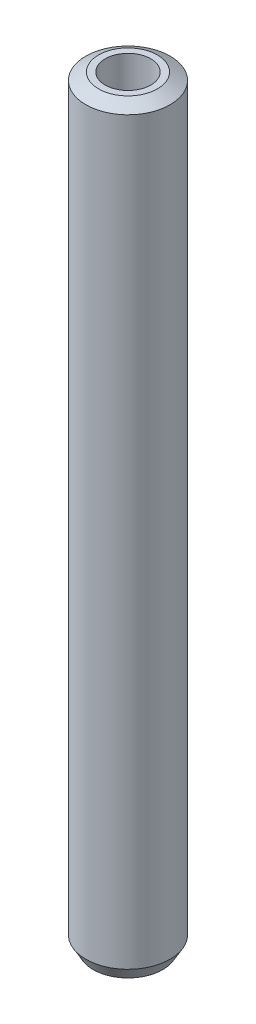
ISO-10303-21;
HEADER;
FILE_DESCRIPTION(('STEP AP214'),'2;1');
FILE_NAME('part.step','',(''),(''),'','','');
FILE_SCHEMA(('AUTOMOTIVE_DESIGN { 1 0 10303 214 1 1 1 1 }'));
ENDSEC;
DATA;
#1=APPLICATION_CONTEXT('core data for automotive mechanical design processes');
#2=APPLICATION_PROTOCOL_DEFINITION('international standard','automotive_design',2000,#1);
#3=PRODUCT_CONTEXT('',#1,'mechanical');
#4=PRODUCT('Part','Part','',(#3));
#5=PRODUCT_RELATED_PRODUCT_CATEGORY('part','',(#4));
#6=PRODUCT_DEFINITION_FORMATION('','',#4);
#7=PRODUCT_DEFINITION_CONTEXT('part definition',#1,'design');
#8=PRODUCT_DEFINITION('design','',#6,#7);
#9=PRODUCT_DEFINITION_SHAPE('','',#8);
#10=(LENGTH_UNIT() NAMED_UNIT(*) SI_UNIT(.MILLI.,.METRE.));
#11=(NAMED_UNIT(*) PLANE_ANGLE_UNIT() SI_UNIT($,.RADIAN.));
#12=(NAMED_UNIT(*) SI_UNIT($,.STERADIAN.) SOLID_ANGLE_UNIT());
#13=UNCERTAINTY_MEASURE_WITH_UNIT(LENGTH_MEASURE(1.E-05),#10,'distance_accuracy_value','');
#14=(GEOMETRIC_REPRESENTATION_CONTEXT(3) GLOBAL_UNCERTAINTY_ASSIGNED_CONTEXT((#13)) GLOBAL_UNIT_ASSIGNED_CONTEXT((#10,
#11,#12)) REPRESENTATION_CONTEXT('',''));
#15=CARTESIAN_POINT('',(0.,0.,0.));
#16=DIRECTION('',(0.,0.,1.));
#17=DIRECTION('',(1.,0.,0.));
#18=AXIS2_PLACEMENT_3D('',#15,#16,#17);
#19=CARTESIAN_POINT('',(0.,586.143162076353,0.));
#20=DIRECTION('',(0.,-1.,0.));
#21=DIRECTION('',(0.,0.,-1.));
#22=AXIS2_PLACEMENT_3D('',#19,#20,#21);
#23=CYLINDRICAL_SURFACE('',#22,32.5);
#24=CARTESIAN_POINT('',(0.,580.472385568864,0.));
#25=DIRECTION('',(0.,1.,0.));
#26=DIRECTION('',(0.,0.,1.));
#27=AXIS2_PLACEMENT_3D('',#24,#25,#26);
#28=CIRCLE('',#27,32.5);
#29=CARTESIAN_POINT('',(0.,580.472385568864,32.5));
#30=VERTEX_POINT('',#29);
#31=EDGE_CURVE('E50',#30,#30,#28,.F.);
#32=ORIENTED_EDGE('',*,*,#31,.T.);
#33=EDGE_LOOP('',(#32));
#34=FACE_BOUND('',#33,.T.);
#35=CARTESIAN_POINT('',(0.,9.82207302934002,0.));
#36=DIRECTION('',(0.,1.,0.));
#37=DIRECTION('',(0.,0.,1.));
#38=AXIS2_PLACEMENT_3D('',#35,#36,#37);
#39=CIRCLE('',#38,32.5);
#40=CARTESIAN_POINT('',(0.,9.82207302934002,32.5));
#41=VERTEX_POINT('',#40);
#42=EDGE_CURVE('E51',#41,#41,#39,.T.);
#43=ORIENTED_EDGE('',*,*,#42,.T.);
#44=EDGE_LOOP('',(#43));
#45=FACE_BOUND('',#44,.T.);
#46=ADVANCED_FACE('F39',(#34,#45),#23,.T.);
#47=CARTESIAN_POINT('',(0.,586.143162076353,0.));
#48=DIRECTION('',(0.,1.,0.));
#49=DIRECTION('',(0.,0.,1.));
#50=AXIS2_PLACEMENT_3D('',#47,#48,#49);
#51=PLANE('',#50);
#52=CARTESIAN_POINT('',(0.,586.143162076353,0.));
#53=DIRECTION('',(0.,1.,0.));
#54=DIRECTION('',(0.,0.,1.));
#55=AXIS2_PLACEMENT_3D('',#52,#53,#54);
#56=CIRCLE('',#55,22.6779269706597);
#57=CARTESIAN_POINT('',(0.,586.143162076353,22.6779269706597));
#58=VERTEX_POINT('',#57);
#59=EDGE_CURVE('E54',#58,#58,#56,.T.);
#60=ORIENTED_EDGE('',*,*,#59,.T.);
#61=EDGE_LOOP('',(#60));
#62=FACE_BOUND('',#61,.T.);
#63=CARTESIAN_POINT('',(0.,586.143162076353,0.));
#64=DIRECTION('',(0.,1.,0.));
#65=DIRECTION('',(0.,0.,1.));
#66=AXIS2_PLACEMENT_3D('',#63,#64,#65);
#67=CIRCLE('',#66,17.5743885016988);
#68=CARTESIAN_POINT('',(0.,586.143162076353,17.5743885016988));
#69=VERTEX_POINT('',#68);
#70=EDGE_CURVE('E58',#69,#69,#67,.T.);
#71=ORIENTED_EDGE('',*,*,#70,.F.);
#72=EDGE_LOOP('',(#71));
#73=FACE_BOUND('',#72,.T.);
#74=ADVANCED_FACE('F69',(#62,#73),#51,.T.);
#75=CARTESIAN_POINT('',(0.,0.,0.));
#76=DIRECTION('',(0.,1.,0.));
#77=DIRECTION('',(0.,0.,1.));
#78=AXIS2_PLACEMENT_3D('',#75,#76,#77);
#79=PLANE('',#78);
#80=CARTESIAN_POINT('',(0.,0.,0.));
#81=DIRECTION('',(0.,1.,0.));
#82=DIRECTION('',(0.,0.,1.));
#83=AXIS2_PLACEMENT_3D('',#80,#81,#82);
#84=CIRCLE('',#83,26.8292234925104);
#85=CARTESIAN_POINT('',(0.,0.,26.8292234925104));
#86=VERTEX_POINT('',#85);
#87=EDGE_CURVE('E10',#86,#86,#84,.F.);
#88=ORIENTED_EDGE('',*,*,#87,.T.);
#89=EDGE_LOOP('',(#88));
#90=FACE_BOUND('',#89,.T.);
#91=CARTESIAN_POINT('',(0.,0.,0.));
#92=DIRECTION('',(0.,1.,0.));
#93=DIRECTION('',(0.,0.,1.));
#94=AXIS2_PLACEMENT_3D('',#91,#92,#93);
#95=CIRCLE('',#94,17.5743885016988);
#96=CARTESIAN_POINT('',(0.,0.,17.5743885016988));
#97=VERTEX_POINT('',#96);
#98=EDGE_CURVE('E63',#97,#97,#95,.T.);
#99=ORIENTED_EDGE('',*,*,#98,.T.);
#100=EDGE_LOOP('',(#99));
#101=FACE_BOUND('',#100,.T.);
#102=ADVANCED_FACE('F75',(#90,#101),#79,.F.);
#103=CARTESIAN_POINT('',(0.,586.143162076353,0.));
#104=DIRECTION('',(0.,-1.,0.));
#105=DIRECTION('',(0.,0.,-1.));
#106=AXIS2_PLACEMENT_3D('',#103,#104,#105);
#107=CYLINDRICAL_SURFACE('',#106,17.5743885016988);
#108=ORIENTED_EDGE('',*,*,#70,.T.);
#109=EDGE_LOOP('',(#108));
#110=FACE_BOUND('',#109,.T.);
#111=ORIENTED_EDGE('',*,*,#98,.F.);
#112=EDGE_LOOP('',(#111));
#113=FACE_BOUND('',#112,.T.);
#114=ADVANCED_FACE('F70',(#110,#113),#107,.F.);
#115=CARTESIAN_POINT('',(0.,586.143162076353,0.));
#116=DIRECTION('',(0.,-1.,0.));
#117=DIRECTION('',(0.,0.,-1.));
#118=AXIS2_PLACEMENT_3D('',#115,#116,#117);
#119=CONICAL_SURFACE('',#118,22.6779269706597,1.0471975511966);
#120=ORIENTED_EDGE('',*,*,#31,.F.);
#121=EDGE_LOOP('',(#120));
#122=FACE_BOUND('',#121,.T.);
#123=ORIENTED_EDGE('',*,*,#59,.F.);
#124=EDGE_LOOP('',(#123));
#125=FACE_BOUND('',#124,.T.);
#126=ADVANCED_FACE('F81',(#122,#125),#119,.T.);
#127=CARTESIAN_POINT('',(0.,9.82207302934002,0.));
#128=DIRECTION('',(0.,1.,0.));
#129=DIRECTION('',(0.,0.,1.));
#130=AXIS2_PLACEMENT_3D('',#127,#128,#129);
#131=CONICAL_SURFACE('',#130,32.5,0.523598775598299);
#132=CARTESIAN_POINT('',(0.,0.,26.8292234925104));
#133=CARTESIAN_POINT('',(0.,0.102313260722291,26.8882940811301));
#134=CARTESIAN_POINT('',(0.,0.204626521444582,26.9473646697497));
#135=CARTESIAN_POINT('',(0.,0.409253042889166,27.0655058469891));
#136=CARTESIAN_POINT('',(0.,0.511566303611457,27.1245764356088));
#137=CARTESIAN_POINT('',(0.,0.716192825056041,27.2427176128482));
#138=CARTESIAN_POINT('',(0.,0.818506085778333,27.3017882014678));
#139=CARTESIAN_POINT('',(0.,1.02313260722292,27.4199293787072));
#140=CARTESIAN_POINT('',(0.,1.12544586794521,27.4789999673269));
#141=CARTESIAN_POINT('',(0.,1.33007238938979,27.5971411445663));
#142=CARTESIAN_POINT('',(0.,1.43238565011208,27.6562117331859));
#143=CARTESIAN_POINT('',(0.,1.63701217155667,27.7743529104253));
#144=CARTESIAN_POINT('',(0.,1.73932543227896,27.833423499045));
#145=CARTESIAN_POINT('',(0.,1.94395195372354,27.9515646762844));
#146=CARTESIAN_POINT('',(0.,2.04626521444583,28.010635264904));
#147=CARTESIAN_POINT('',(0.,2.25089173589042,28.1287764421434));
#148=CARTESIAN_POINT('',(0.,2.35320499661271,28.1878470307631));
#149=CARTESIAN_POINT('',(0.,2.55783151805729,28.3059882080025));
#150=CARTESIAN_POINT('',(0.,2.66014477877959,28.3650587966221));
#151=CARTESIAN_POINT('',(0.,2.86477130022417,28.4831999738615));
#152=CARTESIAN_POINT('',(0.,2.96708456094646,28.5422705624812));
#153=CARTESIAN_POINT('',(0.,3.17171108239104,28.6604117397206));
#154=CARTESIAN_POINT('',(0.,3.27402434311334,28.7194823283403));
#155=CARTESIAN_POINT('',(0.,3.47865086455792,28.8376235055796));
#156=CARTESIAN_POINT('',(0.,3.58096412528021,28.8966940941993));
#157=CARTESIAN_POINT('',(0.,3.7855906467248,29.0148352714387));
#158=CARTESIAN_POINT('',(0.,3.88790390744709,29.0739058600583));
#159=CARTESIAN_POINT('',(0.,4.09253042889167,29.1920470372977));
#160=CARTESIAN_POINT('',(0.,4.19484368961396,29.2511176259174));
#161=CARTESIAN_POINT('',(0.,4.39947021105855,29.3692588031568));
#162=CARTESIAN_POINT('',(0.,4.50178347178084,29.4283293917765));
#163=CARTESIAN_POINT('',(0.,4.70640999322542,29.5464705690158));
#164=CARTESIAN_POINT('',(0.,4.80872325394771,29.6055411576355));
#165=CARTESIAN_POINT('',(0.,5.0133497753923,29.7236823348749));
#166=CARTESIAN_POINT('',(0.,5.11566303611459,29.7827529234946));
#167=CARTESIAN_POINT('',(0.,5.32028955755917,29.9008941007339));
#168=CARTESIAN_POINT('',(0.,5.42260281828147,29.9599646893536));
#169=CARTESIAN_POINT('',(0.,5.62722933972605,30.078105866593));
#170=CARTESIAN_POINT('',(0.,5.72954260044834,30.1371764552127));
#171=CARTESIAN_POINT('',(0.,5.93416912189292,30.255317632452));
#172=CARTESIAN_POINT('',(0.,6.03648238261522,30.3143882210717));
#173=CARTESIAN_POINT('',(0.,6.2411089040598,30.4325293983111));
#174=CARTESIAN_POINT('',(0.,6.34342216478209,30.4915999869308));
#175=CARTESIAN_POINT('',(0.,6.54804868622668,30.6097411641701));
#176=CARTESIAN_POINT('',(0.,6.65036194694897,30.6688117527898));
#177=CARTESIAN_POINT('',(0.,6.85498846839355,30.7869529300292));
#178=CARTESIAN_POINT('',(0.,6.95730172911584,30.8460235186489));
#179=CARTESIAN_POINT('',(0.,7.16192825056043,30.9641646958882));
#180=CARTESIAN_POINT('',(0.,7.26424151128272,31.0232352845079));
#181=CARTESIAN_POINT('',(0.,7.4688680327273,31.1413764617473));
#182=CARTESIAN_POINT('',(0.,7.5711812934496,31.200447050367));
#183=CARTESIAN_POINT('',(0.,7.77580781489418,31.3185882276063));
#184=CARTESIAN_POINT('',(0.,7.87812107561647,31.377658816226));
#185=CARTESIAN_POINT('',(0.,8.08274759706105,31.4957999934654));
#186=CARTESIAN_POINT('',(0.,8.18506085778334,31.5548705820851));
#187=CARTESIAN_POINT('',(0.,8.38968737922793,31.6730117593244));
#188=CARTESIAN_POINT('',(0.,8.49200063995022,31.7320823479441));
#189=CARTESIAN_POINT('',(0.,8.69662716139481,31.8502235251835));
#190=CARTESIAN_POINT('',(0.,8.7989404221171,31.9092941138032));
#191=CARTESIAN_POINT('',(0.,9.00356694356168,32.0274352910425));
#192=CARTESIAN_POINT('',(0.,9.10588020428397,32.0865058796622));
#193=CARTESIAN_POINT('',(0.,9.31050672572855,32.2046470569016));
#194=CARTESIAN_POINT('',(0.,9.41281998645085,32.2637176455213));
#195=CARTESIAN_POINT('',(0.,9.61744650789543,32.3818588227606));
#196=CARTESIAN_POINT('',(0.,9.71975976861772,32.4409294113803));
#197=CARTESIAN_POINT('',(0.,9.82207302934002,32.5));
#198=B_SPLINE_CURVE_WITH_KNOTS('',3,(#132,#133,#134,#135,#136,#137,#138,#139,#140,#141,#142,
#143,#144,#145,#146,#147,#148,#149,#150,#151,#152,#153,#154,#155,#156,#157,#158,#159,#160,#161,
#162,#163,#164,#165,#166,#167,#168,#169,#170,#171,#172,#173,#174,#175,#176,#177,#178,#179,#180,
#181,#182,#183,#184,#185,#186,#187,#188,#189,#190,#191,#192,#193,#194,#195,#196,#197),
.UNSPECIFIED.,.F.,.F.,(4,2,2,2,2,2,2,2,2,2,2,2,2,2,2,2,2,2,2,2,2,2,2,2,2,2,2,2,2,2,2,2,4),(0.,
0.354423531718101,0.708847063436204,1.0632705951543,1.41769412687241,1.77211765859051,
2.12654119030861,2.48096472202671,2.83538825374481,3.18981178546291,3.54423531718101,
3.89865884889911,4.25308238061722,4.60750591233532,4.96192944405342,5.31635297577152,
5.67077650748962,6.02520003920772,6.37962357092583,6.73404710264393,7.08847063436203,
7.44289416608013,7.79731769779823,8.15174122951633,8.50616476123443,8.86058829295253,
9.21501182467064,9.56943535638874,9.92385888810684,10.2782824198249,10.632705951543,
10.9871294832611,11.3415530149792),.UNSPECIFIED.);
#199=EDGE_CURVE('BSEAM45',#86,#41,#198,.T.);
#200=ORIENTED_EDGE('',*,*,#87,.F.);
#201=ORIENTED_EDGE('',*,*,#42,.F.);
#202=ORIENTED_EDGE('',*,*,#199,.T.);
#203=ORIENTED_EDGE('',*,*,#199,.F.);
#204=EDGE_LOOP('',(#200,#202,#201,#203));
#205=FACE_BOUND('',#204,.T.);
#206=ADVANCED_FACE('F45',(#205),#131,.T.);
#207=CLOSED_SHELL('',(#46,#74,#102,#114,#126,#206));
#208=MANIFOLD_SOLID_BREP('B2',#207);
#209=ADVANCED_BREP_SHAPE_REPRESENTATION('',(#18,#208),#14);
#210=SHAPE_DEFINITION_REPRESENTATION(#9,#209);
ENDSEC;
END-ISO-10303-21;
